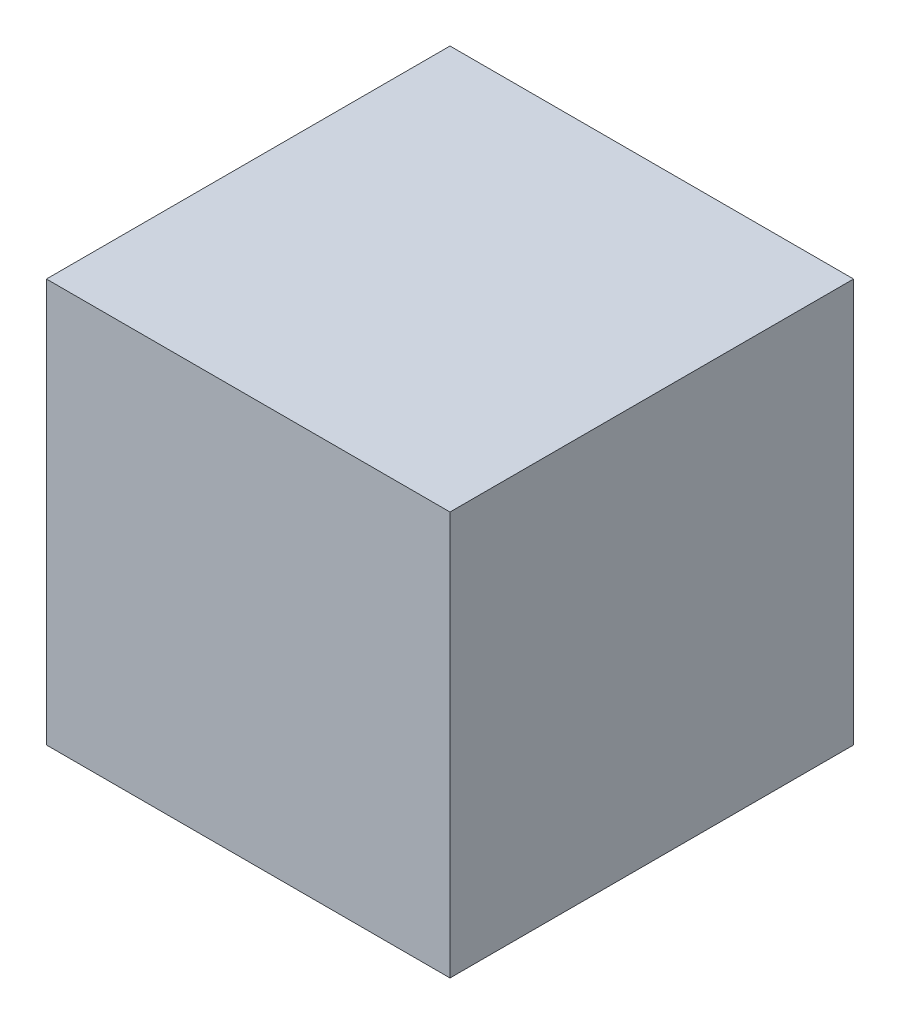
ISO-10303-21;
HEADER;
FILE_DESCRIPTION(('STEP AP214'),'2;1');
FILE_NAME('part.step','',(''),(''),'','','');
FILE_SCHEMA(('AUTOMOTIVE_DESIGN { 1 0 10303 214 1 1 1 1 }'));
ENDSEC;
DATA;
#1=APPLICATION_CONTEXT('core data for automotive mechanical design processes');
#2=APPLICATION_PROTOCOL_DEFINITION('international standard','automotive_design',2000,#1);
#3=PRODUCT_CONTEXT('',#1,'mechanical');
#4=PRODUCT('Part','Part','',(#3));
#5=PRODUCT_RELATED_PRODUCT_CATEGORY('part','',(#4));
#6=PRODUCT_DEFINITION_FORMATION('','',#4);
#7=PRODUCT_DEFINITION_CONTEXT('part definition',#1,'design');
#8=PRODUCT_DEFINITION('design','',#6,#7);
#9=PRODUCT_DEFINITION_SHAPE('','',#8);
#10=(LENGTH_UNIT() NAMED_UNIT(*) SI_UNIT(.MILLI.,.METRE.));
#11=(NAMED_UNIT(*) PLANE_ANGLE_UNIT() SI_UNIT($,.RADIAN.));
#12=(NAMED_UNIT(*) SI_UNIT($,.STERADIAN.) SOLID_ANGLE_UNIT());
#13=UNCERTAINTY_MEASURE_WITH_UNIT(LENGTH_MEASURE(1.E-05),#10,'distance_accuracy_value','');
#14=(GEOMETRIC_REPRESENTATION_CONTEXT(3) GLOBAL_UNCERTAINTY_ASSIGNED_CONTEXT((#13)) GLOBAL_UNIT_ASSIGNED_CONTEXT((#10,
#11,#12)) REPRESENTATION_CONTEXT('',''));
#15=CARTESIAN_POINT('',(0.,0.,0.));
#16=DIRECTION('',(0.,0.,1.));
#17=DIRECTION('',(1.,0.,0.));
#18=AXIS2_PLACEMENT_3D('',#15,#16,#17);
#19=CARTESIAN_POINT('',(127.,-127.,127.));
#20=DIRECTION('',(-1.,0.,0.));
#21=DIRECTION('',(0.,0.,1.));
#22=AXIS2_PLACEMENT_3D('',#19,#20,#21);
#23=PLANE('',#22);
#24=DIRECTION('',(0.,1.,0.));
#25=VECTOR('',#24,1.);
#26=CARTESIAN_POINT('',(127.,-127.,-127.));
#27=LINE('',#26,#25);
#28=CARTESIAN_POINT('',(127.,-127.,-127.));
#29=VERTEX_POINT('',#28);
#30=CARTESIAN_POINT('',(127.,127.,-127.));
#31=VERTEX_POINT('',#30);
#32=EDGE_CURVE('E100',#29,#31,#27,.T.);
#33=ORIENTED_EDGE('',*,*,#32,.T.);
#34=DIRECTION('',(0.,0.,-1.));
#35=VECTOR('',#34,1.);
#36=CARTESIAN_POINT('',(127.,127.,127.));
#37=LINE('',#36,#35);
#38=CARTESIAN_POINT('',(127.,127.,127.));
#39=VERTEX_POINT('',#38);
#40=EDGE_CURVE('E11',#39,#31,#37,.T.);
#41=ORIENTED_EDGE('',*,*,#40,.F.);
#42=DIRECTION('',(0.,1.,0.));
#43=VECTOR('',#42,1.);
#44=CARTESIAN_POINT('',(127.,-127.,127.));
#45=LINE('',#44,#43);
#46=CARTESIAN_POINT('',(127.,-127.,127.));
#47=VERTEX_POINT('',#46);
#48=EDGE_CURVE('E88',#47,#39,#45,.T.);
#49=ORIENTED_EDGE('',*,*,#48,.F.);
#50=DIRECTION('',(0.,0.,-1.));
#51=VECTOR('',#50,1.);
#52=CARTESIAN_POINT('',(127.,-127.,127.));
#53=LINE('',#52,#51);
#54=EDGE_CURVE('E96',#47,#29,#53,.T.);
#55=ORIENTED_EDGE('',*,*,#54,.T.);
#56=EDGE_LOOP('',(#33,#41,#49,#55));
#57=FACE_BOUND('',#56,.T.);
#58=ADVANCED_FACE('F37',(#57),#23,.F.);
#59=CARTESIAN_POINT('',(-127.,127.,127.));
#60=DIRECTION('',(0.,-1.,0.));
#61=DIRECTION('',(0.,0.,-1.));
#62=AXIS2_PLACEMENT_3D('',#59,#60,#61);
#63=PLANE('',#62);
#64=DIRECTION('',(-1.,0.,0.));
#65=VECTOR('',#64,1.);
#66=CARTESIAN_POINT('',(-127.,127.,-127.));
#67=LINE('',#66,#65);
#68=CARTESIAN_POINT('',(-127.,127.,-127.));
#69=VERTEX_POINT('',#68);
#70=EDGE_CURVE('E92',#31,#69,#67,.T.);
#71=ORIENTED_EDGE('',*,*,#70,.T.);
#72=DIRECTION('',(0.,0.,-1.));
#73=VECTOR('',#72,1.);
#74=CARTESIAN_POINT('',(-127.,127.,127.));
#75=LINE('',#74,#73);
#76=CARTESIAN_POINT('',(-127.,127.,127.));
#77=VERTEX_POINT('',#76);
#78=EDGE_CURVE('E45',#77,#69,#75,.T.);
#79=ORIENTED_EDGE('',*,*,#78,.F.);
#80=DIRECTION('',(-1.,0.,0.));
#81=VECTOR('',#80,1.);
#82=CARTESIAN_POINT('',(-127.,127.,127.));
#83=LINE('',#82,#81);
#84=EDGE_CURVE('E83',#39,#77,#83,.T.);
#85=ORIENTED_EDGE('',*,*,#84,.F.);
#86=ORIENTED_EDGE('',*,*,#40,.T.);
#87=EDGE_LOOP('',(#71,#79,#85,#86));
#88=FACE_BOUND('',#87,.T.);
#89=ADVANCED_FACE('F91',(#88),#63,.F.);
#90=CARTESIAN_POINT('',(-127.,-127.,127.));
#91=DIRECTION('',(1.,0.,0.));
#92=DIRECTION('',(0.,0.,-1.));
#93=AXIS2_PLACEMENT_3D('',#90,#91,#92);
#94=PLANE('',#93);
#95=DIRECTION('',(0.,-1.,0.));
#96=VECTOR('',#95,1.);
#97=CARTESIAN_POINT('',(-127.,-127.,-127.));
#98=LINE('',#97,#96);
#99=CARTESIAN_POINT('',(-127.,-127.,-127.));
#100=VERTEX_POINT('',#99);
#101=EDGE_CURVE('E70',#69,#100,#98,.T.);
#102=ORIENTED_EDGE('',*,*,#101,.T.);
#103=DIRECTION('',(0.,0.,-1.));
#104=VECTOR('',#103,1.);
#105=CARTESIAN_POINT('',(-127.,-127.,127.));
#106=LINE('',#105,#104);
#107=CARTESIAN_POINT('',(-127.,-127.,127.));
#108=VERTEX_POINT('',#107);
#109=EDGE_CURVE('E93',#108,#100,#106,.T.);
#110=ORIENTED_EDGE('',*,*,#109,.F.);
#111=DIRECTION('',(0.,-1.,0.));
#112=VECTOR('',#111,1.);
#113=CARTESIAN_POINT('',(-127.,-127.,127.));
#114=LINE('',#113,#112);
#115=EDGE_CURVE('E86',#77,#108,#114,.T.);
#116=ORIENTED_EDGE('',*,*,#115,.F.);
#117=ORIENTED_EDGE('',*,*,#78,.T.);
#118=EDGE_LOOP('',(#102,#110,#116,#117));
#119=FACE_BOUND('',#118,.T.);
#120=ADVANCED_FACE('F94',(#119),#94,.F.);
#121=CARTESIAN_POINT('',(-127.,-127.,127.));
#122=DIRECTION('',(0.,1.,0.));
#123=DIRECTION('',(0.,0.,1.));
#124=AXIS2_PLACEMENT_3D('',#121,#122,#123);
#125=PLANE('',#124);
#126=DIRECTION('',(1.,0.,0.));
#127=VECTOR('',#126,1.);
#128=CARTESIAN_POINT('',(-127.,-127.,-127.));
#129=LINE('',#128,#127);
#130=EDGE_CURVE('E76',#100,#29,#129,.T.);
#131=ORIENTED_EDGE('',*,*,#130,.T.);
#132=ORIENTED_EDGE('',*,*,#54,.F.);
#133=DIRECTION('',(1.,0.,0.));
#134=VECTOR('',#133,1.);
#135=CARTESIAN_POINT('',(-127.,-127.,127.));
#136=LINE('',#135,#134);
#137=EDGE_CURVE('E53',#108,#47,#136,.T.);
#138=ORIENTED_EDGE('',*,*,#137,.F.);
#139=ORIENTED_EDGE('',*,*,#109,.T.);
#140=EDGE_LOOP('',(#131,#132,#138,#139));
#141=FACE_BOUND('',#140,.T.);
#142=ADVANCED_FACE('F107',(#141),#125,.F.);
#143=CARTESIAN_POINT('',(0.,0.,127.));
#144=DIRECTION('',(0.,0.,-1.));
#145=DIRECTION('',(-1.,0.,0.));
#146=AXIS2_PLACEMENT_3D('',#143,#144,#145);
#147=PLANE('',#146);
#148=ORIENTED_EDGE('',*,*,#48,.T.);
#149=ORIENTED_EDGE('',*,*,#84,.T.);
#150=ORIENTED_EDGE('',*,*,#115,.T.);
#151=ORIENTED_EDGE('',*,*,#137,.T.);
#152=EDGE_LOOP('',(#148,#149,#150,#151));
#153=FACE_BOUND('',#152,.T.);
#154=ADVANCED_FACE('F84',(#153),#147,.F.);
#155=CARTESIAN_POINT('',(0.,0.,-127.));
#156=DIRECTION('',(0.,0.,-1.));
#157=DIRECTION('',(-1.,0.,0.));
#158=AXIS2_PLACEMENT_3D('',#155,#156,#157);
#159=PLANE('',#158);
#160=ORIENTED_EDGE('',*,*,#32,.F.);
#161=ORIENTED_EDGE('',*,*,#130,.F.);
#162=ORIENTED_EDGE('',*,*,#101,.F.);
#163=ORIENTED_EDGE('',*,*,#70,.F.);
#164=EDGE_LOOP('',(#160,#161,#162,#163));
#165=FACE_BOUND('',#164,.T.);
#166=ADVANCED_FACE('F110',(#165),#159,.T.);
#167=CLOSED_SHELL('',(#58,#89,#120,#142,#154,#166));
#168=MANIFOLD_SOLID_BREP('B2',#167);
#169=ADVANCED_BREP_SHAPE_REPRESENTATION('',(#18,#168),#14);
#170=SHAPE_DEFINITION_REPRESENTATION(#9,#169);
ENDSEC;
END-ISO-10303-21;
